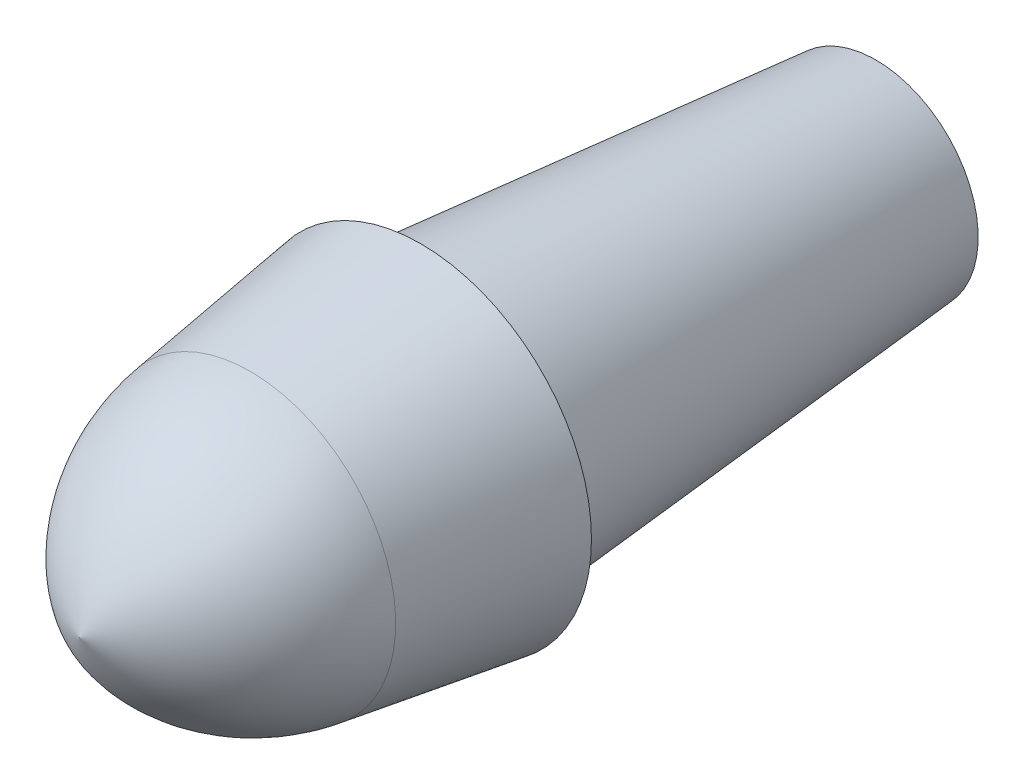
ISO-10303-21;
HEADER;
FILE_DESCRIPTION(('STEP AP214'),'2;1');
FILE_NAME('part.step','',(''),(''),'','','');
FILE_SCHEMA(('AUTOMOTIVE_DESIGN { 1 0 10303 214 1 1 1 1 }'));
ENDSEC;
DATA;
#1=APPLICATION_CONTEXT('core data for automotive mechanical design processes');
#2=APPLICATION_PROTOCOL_DEFINITION('international standard','automotive_design',2000,#1);
#3=PRODUCT_CONTEXT('',#1,'mechanical');
#4=PRODUCT('Part','Part','',(#3));
#5=PRODUCT_RELATED_PRODUCT_CATEGORY('part','',(#4));
#6=PRODUCT_DEFINITION_FORMATION('','',#4);
#7=PRODUCT_DEFINITION_CONTEXT('part definition',#1,'design');
#8=PRODUCT_DEFINITION('design','',#6,#7);
#9=PRODUCT_DEFINITION_SHAPE('','',#8);
#10=(LENGTH_UNIT() NAMED_UNIT(*) SI_UNIT(.MILLI.,.METRE.));
#11=(NAMED_UNIT(*) PLANE_ANGLE_UNIT() SI_UNIT($,.RADIAN.));
#12=(NAMED_UNIT(*) SI_UNIT($,.STERADIAN.) SOLID_ANGLE_UNIT());
#13=UNCERTAINTY_MEASURE_WITH_UNIT(LENGTH_MEASURE(1.E-05),#10,'distance_accuracy_value','');
#14=(GEOMETRIC_REPRESENTATION_CONTEXT(3) GLOBAL_UNCERTAINTY_ASSIGNED_CONTEXT((#13)) GLOBAL_UNIT_ASSIGNED_CONTEXT((#10,
#11,#12)) REPRESENTATION_CONTEXT('',''));
#15=CARTESIAN_POINT('',(0.,0.,0.));
#16=DIRECTION('',(0.,0.,1.));
#17=DIRECTION('',(1.,0.,0.));
#18=AXIS2_PLACEMENT_3D('',#15,#16,#17);
#19=CARTESIAN_POINT('',(0.,0.,0.));
#20=DIRECTION('',(0.,0.,-1.));
#21=DIRECTION('',(-1.,0.,0.));
#22=AXIS2_PLACEMENT_3D('',#19,#20,#21);
#23=PLANE('',#22);
#24=CARTESIAN_POINT('',(0.,0.,0.));
#25=DIRECTION('',(0.,0.,-1.));
#26=DIRECTION('',(-1.,0.,0.));
#27=AXIS2_PLACEMENT_3D('',#24,#25,#26);
#28=CIRCLE('',#27,7.5);
#29=CARTESIAN_POINT('',(-7.5,0.,0.));
#30=VERTEX_POINT('',#29);
#31=EDGE_CURVE('E12',#30,#30,#28,.T.);
#32=ORIENTED_EDGE('',*,*,#31,.T.);
#33=EDGE_LOOP('',(#32));
#34=FACE_BOUND('',#33,.T.);
#35=CARTESIAN_POINT('',(0.,0.,0.));
#36=DIRECTION('',(0.,0.,-1.));
#37=DIRECTION('',(-1.,0.,0.));
#38=AXIS2_PLACEMENT_3D('',#35,#36,#37);
#39=CIRCLE('',#38,6.25);
#40=CARTESIAN_POINT('',(-6.25,0.,0.));
#41=VERTEX_POINT('',#40);
#42=EDGE_CURVE('E59',#41,#41,#39,.T.);
#43=ORIENTED_EDGE('',*,*,#42,.F.);
#44=EDGE_LOOP('',(#43));
#45=FACE_BOUND('',#44,.T.);
#46=ADVANCED_FACE('F39',(#34,#45),#23,.T.);
#47=CARTESIAN_POINT('',(0.,0.,0.));
#48=DIRECTION('',(0.,0.,-1.));
#49=DIRECTION('',(-1.,0.,0.));
#50=AXIS2_PLACEMENT_3D('',#47,#48,#49);
#51=CONICAL_SURFACE('',#50,7.5,0.146583417066011);
#52=CARTESIAN_POINT('',(0.,0.,7.5));
#53=DIRECTION('',(0.,0.,-1.));
#54=DIRECTION('',(-1.,0.,0.));
#55=AXIS2_PLACEMENT_3D('',#52,#53,#54);
#56=CIRCLE('',#55,6.39268211980974);
#57=CARTESIAN_POINT('',(-6.39268211980974,0.,7.5));
#58=VERTEX_POINT('',#57);
#59=EDGE_CURVE('E45',#58,#58,#56,.T.);
#60=ORIENTED_EDGE('',*,*,#59,.T.);
#61=EDGE_LOOP('',(#60));
#62=FACE_BOUND('',#61,.T.);
#63=ORIENTED_EDGE('',*,*,#31,.F.);
#64=EDGE_LOOP('',(#63));
#65=FACE_BOUND('',#64,.T.);
#66=ADVANCED_FACE('F52',(#62,#65),#51,.T.);
#67=CARTESIAN_POINT('',(2.79461134588402,0.,6.14356608998429));
#68=DIRECTION('',(0.,-1.,0.));
#69=DIRECTION('',(-1.,0.,0.));
#70=AXIS2_PLACEMENT_3D('',#67,#68,#69);
#71=CIRCLE('',#70,9.28688721677074);
#72=TRIMMED_CURVE('',#71,(PARAMETER_VALUE(-1.26513896375061)),
(PARAMETER_VALUE(1.26513896375061)),.T.,.PARAMETER.);
#73=CARTESIAN_POINT('',(0.,0.,6.14356608998429));
#74=DIRECTION('',(0.,0.,-1.));
#75=AXIS1_PLACEMENT('',#73,#74);
#76=SURFACE_OF_REVOLUTION('',#72,#75);
#77=CARTESIAN_POINT('',(0.,0.,15.));
#78=VERTEX_POINT('',#77);
#79=VERTEX_LOOP('',#78);
#80=FACE_BOUND('',#79,.T.);
#81=ORIENTED_EDGE('',*,*,#59,.F.);
#82=EDGE_LOOP('',(#81));
#83=FACE_BOUND('',#82,.T.);
#84=ADVANCED_FACE('F48',(#80,#83),#76,.T.);
#85=CARTESIAN_POINT('',(0.,0.,-20.));
#86=DIRECTION('',(0.,0.,-1.));
#87=DIRECTION('',(-1.,0.,0.));
#88=AXIS2_PLACEMENT_3D('',#85,#86,#87);
#89=PLANE('',#88);
#90=CARTESIAN_POINT('',(0.,0.,-20.));
#91=DIRECTION('',(0.,0.,-1.));
#92=DIRECTION('',(-1.,0.,0.));
#93=AXIS2_PLACEMENT_3D('',#90,#91,#92);
#94=CIRCLE('',#93,4.5);
#95=CARTESIAN_POINT('',(-4.5,0.,-20.));
#96=VERTEX_POINT('',#95);
#97=EDGE_CURVE('E57',#96,#96,#94,.T.);
#98=ORIENTED_EDGE('',*,*,#97,.T.);
#99=EDGE_LOOP('',(#98));
#100=FACE_BOUND('',#99,.T.);
#101=ADVANCED_FACE('F51',(#100),#89,.T.);
#102=CARTESIAN_POINT('',(0.,0.,-20.));
#103=DIRECTION('',(0.,0.,1.));
#104=DIRECTION('',(1.,0.,0.));
#105=AXIS2_PLACEMENT_3D('',#102,#103,#104);
#106=CONICAL_SURFACE('',#105,4.5,0.0872777129494614);
#107=ORIENTED_EDGE('',*,*,#42,.T.);
#108=EDGE_LOOP('',(#107));
#109=FACE_BOUND('',#108,.T.);
#110=ORIENTED_EDGE('',*,*,#97,.F.);
#111=EDGE_LOOP('',(#110));
#112=FACE_BOUND('',#111,.T.);
#113=ADVANCED_FACE('F77',(#109,#112),#106,.T.);
#114=CLOSED_SHELL('',(#46,#66,#84,#101,#113));
#115=MANIFOLD_SOLID_BREP('B2',#114);
#116=ADVANCED_BREP_SHAPE_REPRESENTATION('',(#18,#115),#14);
#117=SHAPE_DEFINITION_REPRESENTATION(#9,#116);
ENDSEC;
END-ISO-10303-21;
